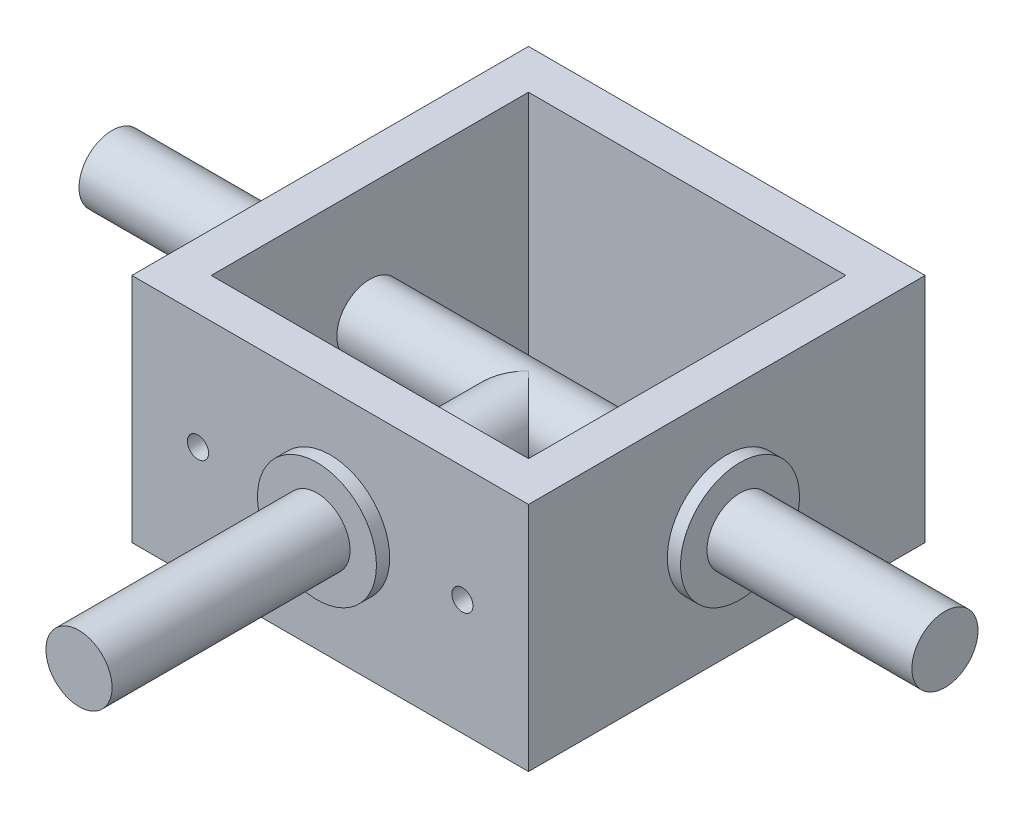
ISO-10303-21;
HEADER;
FILE_DESCRIPTION(('STEP AP214'),'2;1');
FILE_NAME('part.step','',(''),(''),'','','');
FILE_SCHEMA(('AUTOMOTIVE_DESIGN { 1 0 10303 214 1 1 1 1 }'));
ENDSEC;
DATA;
#1=APPLICATION_CONTEXT('core data for automotive mechanical design processes');
#2=APPLICATION_PROTOCOL_DEFINITION('international standard','automotive_design',2000,#1);
#3=PRODUCT_CONTEXT('',#1,'mechanical');
#4=PRODUCT('Part','Part','',(#3));
#5=PRODUCT_RELATED_PRODUCT_CATEGORY('part','',(#4));
#6=PRODUCT_DEFINITION_FORMATION('','',#4);
#7=PRODUCT_DEFINITION_CONTEXT('part definition',#1,'design');
#8=PRODUCT_DEFINITION('design','',#6,#7);
#9=PRODUCT_DEFINITION_SHAPE('','',#8);
#10=(LENGTH_UNIT() NAMED_UNIT(*) SI_UNIT(.MILLI.,.METRE.));
#11=(NAMED_UNIT(*) PLANE_ANGLE_UNIT() SI_UNIT($,.RADIAN.));
#12=(NAMED_UNIT(*) SI_UNIT($,.STERADIAN.) SOLID_ANGLE_UNIT());
#13=UNCERTAINTY_MEASURE_WITH_UNIT(LENGTH_MEASURE(1.E-05),#10,'distance_accuracy_value','');
#14=(GEOMETRIC_REPRESENTATION_CONTEXT(3) GLOBAL_UNCERTAINTY_ASSIGNED_CONTEXT((#13)) GLOBAL_UNIT_ASSIGNED_CONTEXT((#10,
#11,#12)) REPRESENTATION_CONTEXT('',''));
#15=CARTESIAN_POINT('',(0.,0.,0.));
#16=DIRECTION('',(0.,0.,1.));
#17=DIRECTION('',(1.,0.,0.));
#18=AXIS2_PLACEMENT_3D('',#15,#16,#17);
#19=CARTESIAN_POINT('',(-63.,0.,0.));
#20=DIRECTION('',(1.,0.,0.));
#21=DIRECTION('',(0.,0.,-1.));
#22=AXIS2_PLACEMENT_3D('',#19,#20,#21);
#23=CYLINDRICAL_SURFACE('',#22,5.);
#24=CARTESIAN_POINT('',(24.,0.,0.));
#25=DIRECTION('',(1.,0.,0.));
#26=DIRECTION('',(0.,0.,-1.));
#27=AXIS2_PLACEMENT_3D('',#24,#25,#26);
#28=CIRCLE('',#27,5.);
#29=CARTESIAN_POINT('',(24.,0.,-5.));
#30=VERTEX_POINT('',#29);
#31=EDGE_CURVE('E237',#30,#30,#28,.T.);
#32=ORIENTED_EDGE('',*,*,#31,.F.);
#33=EDGE_LOOP('',(#32));
#34=FACE_BOUND('',#33,.T.);
#35=CARTESIAN_POINT('',(-24.,0.,0.));
#36=DIRECTION('',(-1.,0.,0.));
#37=DIRECTION('',(0.,0.,1.));
#38=AXIS2_PLACEMENT_3D('',#35,#36,#37);
#39=CIRCLE('',#38,5.);
#40=CARTESIAN_POINT('',(-24.,0.,5.));
#41=VERTEX_POINT('',#40);
#42=EDGE_CURVE('E233',#41,#41,#39,.T.);
#43=ORIENTED_EDGE('',*,*,#42,.F.);
#44=EDGE_LOOP('',(#43));
#45=FACE_BOUND('',#44,.T.);
#46=CARTESIAN_POINT('',(0.,0.,0.));
#47=DIRECTION('',(0.707106781186547,0.,0.707106781186547));
#48=DIRECTION('',(0.707106781186547,0.,-0.707106781186547));
#49=AXIS2_PLACEMENT_3D('',#46,#47,#48);
#50=ELLIPSE('',#49,7.07106781186547,5.);
#51=CARTESIAN_POINT('',(0.,-5.,0.));
#52=VERTEX_POINT('',#51);
#53=CARTESIAN_POINT('',(0.,5.,0.));
#54=VERTEX_POINT('',#53);
#55=EDGE_CURVE('E109',#52,#54,#50,.F.);
#56=ORIENTED_EDGE('',*,*,#55,.T.);
#57=CARTESIAN_POINT('',(0.,0.,0.));
#58=DIRECTION('',(0.707106781186547,0.,-0.707106781186547));
#59=DIRECTION('',(0.707106781186547,0.,0.707106781186547));
#60=AXIS2_PLACEMENT_3D('',#57,#58,#59);
#61=ELLIPSE('',#60,7.07106781186547,5.);
#62=EDGE_CURVE('E44',#54,#52,#61,.T.);
#63=ORIENTED_EDGE('',*,*,#62,.T.);
#64=EDGE_LOOP('',(#56,#63));
#65=FACE_BOUND('',#64,.T.);
#66=ADVANCED_FACE('F40',(#34,#45,#65),#23,.T.);
#67=CARTESIAN_POINT('',(30.,-17.5,-30.));
#68=DIRECTION('',(1.,0.,0.));
#69=DIRECTION('',(0.,0.,-1.));
#70=AXIS2_PLACEMENT_3D('',#67,#68,#69);
#71=PLANE('',#70);
#72=CARTESIAN_POINT('',(30.,0.,0.));
#73=DIRECTION('',(1.,0.,0.));
#74=DIRECTION('',(0.,0.,-1.));
#75=AXIS2_PLACEMENT_3D('',#72,#73,#74);
#76=CIRCLE('',#75,9.);
#77=CARTESIAN_POINT('',(30.,0.,-9.00000000000001));
#78=VERTEX_POINT('',#77);
#79=EDGE_CURVE('E127',#78,#78,#76,.T.);
#80=ORIENTED_EDGE('',*,*,#79,.F.);
#81=EDGE_LOOP('',(#80));
#82=FACE_BOUND('',#81,.T.);
#83=DIRECTION('',(0.,1.,0.));
#84=VECTOR('',#83,1.);
#85=CARTESIAN_POINT('',(30.,-17.5,-30.));
#86=LINE('',#85,#84);
#87=CARTESIAN_POINT('',(30.,-17.5,-30.));
#88=VERTEX_POINT('',#87);
#89=CARTESIAN_POINT('',(30.,17.5,-30.));
#90=VERTEX_POINT('',#89);
#91=EDGE_CURVE('E144',#88,#90,#86,.T.);
#92=ORIENTED_EDGE('',*,*,#91,.T.);
#93=DIRECTION('',(0.,0.,-1.));
#94=VECTOR('',#93,1.);
#95=CARTESIAN_POINT('',(30.,17.5,-30.));
#96=LINE('',#95,#94);
#97=CARTESIAN_POINT('',(30.,17.5,30.));
#98=VERTEX_POINT('',#97);
#99=EDGE_CURVE('E201',#98,#90,#96,.T.);
#100=ORIENTED_EDGE('',*,*,#99,.F.);
#101=DIRECTION('',(0.,1.,0.));
#102=VECTOR('',#101,1.);
#103=CARTESIAN_POINT('',(30.,-17.5,30.));
#104=LINE('',#103,#102);
#105=CARTESIAN_POINT('',(30.,-17.5,30.));
#106=VERTEX_POINT('',#105);
#107=EDGE_CURVE('E135',#106,#98,#104,.T.);
#108=ORIENTED_EDGE('',*,*,#107,.F.);
#109=DIRECTION('',(0.,0.,-1.));
#110=VECTOR('',#109,1.);
#111=CARTESIAN_POINT('',(30.,-17.5,-30.));
#112=LINE('',#111,#110);
#113=EDGE_CURVE('E159',#106,#88,#112,.T.);
#114=ORIENTED_EDGE('',*,*,#113,.T.);
#115=EDGE_LOOP('',(#92,#100,#108,#114));
#116=FACE_BOUND('',#115,.T.);
#117=ADVANCED_FACE('F42',(#82,#116),#71,.T.);
#118=CARTESIAN_POINT('',(-30.,-17.5,30.));
#119=DIRECTION('',(0.,0.,1.));
#120=DIRECTION('',(1.,0.,0.));
#121=AXIS2_PLACEMENT_3D('',#118,#119,#120);
#122=PLANE('',#121);
#123=CARTESIAN_POINT('',(-20.,0.,30.));
#124=DIRECTION('',(0.,0.,1.));
#125=DIRECTION('',(1.,0.,0.));
#126=AXIS2_PLACEMENT_3D('',#123,#124,#125);
#127=CIRCLE('',#126,1.6);
#128=CARTESIAN_POINT('',(-18.4,0.,30.));
#129=VERTEX_POINT('',#128);
#130=EDGE_CURVE('E257',#129,#129,#127,.T.);
#131=ORIENTED_EDGE('',*,*,#130,.F.);
#132=EDGE_LOOP('',(#131));
#133=FACE_BOUND('',#132,.T.);
#134=CARTESIAN_POINT('',(20.,0.,30.));
#135=DIRECTION('',(0.,0.,1.));
#136=DIRECTION('',(1.,0.,0.));
#137=AXIS2_PLACEMENT_3D('',#134,#135,#136);
#138=CIRCLE('',#137,1.6);
#139=CARTESIAN_POINT('',(21.6,0.,30.));
#140=VERTEX_POINT('',#139);
#141=EDGE_CURVE('E265',#140,#140,#138,.T.);
#142=ORIENTED_EDGE('',*,*,#141,.F.);
#143=EDGE_LOOP('',(#142));
#144=FACE_BOUND('',#143,.T.);
#145=CARTESIAN_POINT('',(0.,0.,30.));
#146=DIRECTION('',(0.,0.,1.));
#147=DIRECTION('',(1.,0.,0.));
#148=AXIS2_PLACEMENT_3D('',#145,#146,#147);
#149=CIRCLE('',#148,9.);
#150=CARTESIAN_POINT('',(9.,0.,30.));
#151=VERTEX_POINT('',#150);
#152=EDGE_CURVE('E131',#151,#151,#149,.T.);
#153=ORIENTED_EDGE('',*,*,#152,.F.);
#154=EDGE_LOOP('',(#153));
#155=FACE_BOUND('',#154,.T.);
#156=ORIENTED_EDGE('',*,*,#107,.T.);
#157=DIRECTION('',(1.,0.,0.));
#158=VECTOR('',#157,1.);
#159=CARTESIAN_POINT('',(-30.,17.5,30.));
#160=LINE('',#159,#158);
#161=CARTESIAN_POINT('',(-30.,17.5,30.));
#162=VERTEX_POINT('',#161);
#163=EDGE_CURVE('E189',#162,#98,#160,.T.);
#164=ORIENTED_EDGE('',*,*,#163,.F.);
#165=DIRECTION('',(0.,1.,0.));
#166=VECTOR('',#165,1.);
#167=CARTESIAN_POINT('',(-30.,-17.5,30.));
#168=LINE('',#167,#166);
#169=CARTESIAN_POINT('',(-30.,-17.5,30.));
#170=VERTEX_POINT('',#169);
#171=EDGE_CURVE('E138',#170,#162,#168,.T.);
#172=ORIENTED_EDGE('',*,*,#171,.F.);
#173=DIRECTION('',(1.,0.,0.));
#174=VECTOR('',#173,1.);
#175=CARTESIAN_POINT('',(-30.,-17.5,30.));
#176=LINE('',#175,#174);
#177=EDGE_CURVE('E147',#170,#106,#176,.T.);
#178=ORIENTED_EDGE('',*,*,#177,.T.);
#179=EDGE_LOOP('',(#156,#164,#172,#178));
#180=FACE_BOUND('',#179,.T.);
#181=ADVANCED_FACE('F324',(#133,#144,#155,#180),#122,.T.);
#182=CARTESIAN_POINT('',(-30.,-17.5,-30.));
#183=DIRECTION('',(-1.,0.,0.));
#184=DIRECTION('',(0.,0.,1.));
#185=AXIS2_PLACEMENT_3D('',#182,#183,#184);
#186=PLANE('',#185);
#187=CARTESIAN_POINT('',(-30.,0.,0.));
#188=DIRECTION('',(-1.,0.,0.));
#189=DIRECTION('',(0.,0.,1.));
#190=AXIS2_PLACEMENT_3D('',#187,#188,#189);
#191=CIRCLE('',#190,9.);
#192=CARTESIAN_POINT('',(-30.,0.,9.00000000000001));
#193=VERTEX_POINT('',#192);
#194=EDGE_CURVE('E123',#193,#193,#191,.T.);
#195=ORIENTED_EDGE('',*,*,#194,.F.);
#196=EDGE_LOOP('',(#195));
#197=FACE_BOUND('',#196,.T.);
#198=ORIENTED_EDGE('',*,*,#171,.T.);
#199=DIRECTION('',(0.,0.,1.));
#200=VECTOR('',#199,1.);
#201=CARTESIAN_POINT('',(-30.,17.5,-30.));
#202=LINE('',#201,#200);
#203=CARTESIAN_POINT('',(-30.,17.5,-30.));
#204=VERTEX_POINT('',#203);
#205=EDGE_CURVE('E193',#204,#162,#202,.T.);
#206=ORIENTED_EDGE('',*,*,#205,.F.);
#207=DIRECTION('',(0.,1.,0.));
#208=VECTOR('',#207,1.);
#209=CARTESIAN_POINT('',(-30.,-17.5,-30.));
#210=LINE('',#209,#208);
#211=CARTESIAN_POINT('',(-30.,-17.5,-30.));
#212=VERTEX_POINT('',#211);
#213=EDGE_CURVE('E141',#212,#204,#210,.T.);
#214=ORIENTED_EDGE('',*,*,#213,.F.);
#215=DIRECTION('',(0.,0.,1.));
#216=VECTOR('',#215,1.);
#217=CARTESIAN_POINT('',(-30.,-17.5,-30.));
#218=LINE('',#217,#216);
#219=EDGE_CURVE('E151',#212,#170,#218,.T.);
#220=ORIENTED_EDGE('',*,*,#219,.T.);
#221=EDGE_LOOP('',(#198,#206,#214,#220));
#222=FACE_BOUND('',#221,.T.);
#223=ADVANCED_FACE('F359',(#197,#222),#186,.T.);
#224=CARTESIAN_POINT('',(-30.,-17.5,-30.));
#225=DIRECTION('',(0.,0.,-1.));
#226=DIRECTION('',(-1.,0.,0.));
#227=AXIS2_PLACEMENT_3D('',#224,#225,#226);
#228=PLANE('',#227);
#229=ORIENTED_EDGE('',*,*,#213,.T.);
#230=DIRECTION('',(-1.,0.,0.));
#231=VECTOR('',#230,1.);
#232=CARTESIAN_POINT('',(-30.,17.5,-30.));
#233=LINE('',#232,#231);
#234=EDGE_CURVE('E197',#90,#204,#233,.T.);
#235=ORIENTED_EDGE('',*,*,#234,.F.);
#236=ORIENTED_EDGE('',*,*,#91,.F.);
#237=DIRECTION('',(-1.,0.,0.));
#238=VECTOR('',#237,1.);
#239=CARTESIAN_POINT('',(-30.,-17.5,-30.));
#240=LINE('',#239,#238);
#241=EDGE_CURVE('E155',#88,#212,#240,.T.);
#242=ORIENTED_EDGE('',*,*,#241,.T.);
#243=EDGE_LOOP('',(#229,#235,#236,#242));
#244=FACE_BOUND('',#243,.T.);
#245=ADVANCED_FACE('F362',(#244),#228,.T.);
#246=CARTESIAN_POINT('',(0.,-17.5,0.));
#247=DIRECTION('',(0.,1.,0.));
#248=DIRECTION('',(0.,0.,1.));
#249=AXIS2_PLACEMENT_3D('',#246,#247,#248);
#250=PLANE('',#249);
#251=DIRECTION('',(-1.,0.,0.));
#252=VECTOR('',#251,1.);
#253=CARTESIAN_POINT('',(-24.,-17.5,-24.));
#254=LINE('',#253,#252);
#255=CARTESIAN_POINT('',(24.,-17.5,-24.));
#256=VERTEX_POINT('',#255);
#257=CARTESIAN_POINT('',(-24.,-17.5,-24.));
#258=VERTEX_POINT('',#257);
#259=EDGE_CURVE('E175',#256,#258,#254,.T.);
#260=ORIENTED_EDGE('',*,*,#259,.T.);
#261=DIRECTION('',(0.,0.,1.));
#262=VECTOR('',#261,1.);
#263=CARTESIAN_POINT('',(-24.,-17.5,24.));
#264=LINE('',#263,#262);
#265=CARTESIAN_POINT('',(-24.,-17.5,24.));
#266=VERTEX_POINT('',#265);
#267=EDGE_CURVE('E185',#258,#266,#264,.T.);
#268=ORIENTED_EDGE('',*,*,#267,.T.);
#269=DIRECTION('',(1.,0.,0.));
#270=VECTOR('',#269,1.);
#271=CARTESIAN_POINT('',(-24.,-17.5,24.));
#272=LINE('',#271,#270);
#273=CARTESIAN_POINT('',(24.,-17.5,24.));
#274=VERTEX_POINT('',#273);
#275=EDGE_CURVE('E181',#266,#274,#272,.T.);
#276=ORIENTED_EDGE('',*,*,#275,.T.);
#277=DIRECTION('',(0.,0.,-1.));
#278=VECTOR('',#277,1.);
#279=CARTESIAN_POINT('',(24.,-17.5,24.));
#280=LINE('',#279,#278);
#281=EDGE_CURVE('E63',#274,#256,#280,.T.);
#282=ORIENTED_EDGE('',*,*,#281,.T.);
#283=EDGE_LOOP('',(#260,#268,#276,#282));
#284=FACE_BOUND('',#283,.T.);
#285=ORIENTED_EDGE('',*,*,#113,.F.);
#286=ORIENTED_EDGE('',*,*,#177,.F.);
#287=ORIENTED_EDGE('',*,*,#219,.F.);
#288=ORIENTED_EDGE('',*,*,#241,.F.);
#289=EDGE_LOOP('',(#285,#286,#287,#288));
#290=FACE_BOUND('',#289,.T.);
#291=ADVANCED_FACE('F297',(#284,#290),#250,.F.);
#292=CARTESIAN_POINT('',(-24.,-17.5,24.));
#293=DIRECTION('',(-1.,0.,0.));
#294=DIRECTION('',(0.,0.,1.));
#295=AXIS2_PLACEMENT_3D('',#292,#293,#294);
#296=PLANE('',#295);
#297=ORIENTED_EDGE('',*,*,#42,.T.);
#298=EDGE_LOOP('',(#297));
#299=FACE_BOUND('',#298,.T.);
#300=DIRECTION('',(0.,1.,0.));
#301=VECTOR('',#300,1.);
#302=CARTESIAN_POINT('',(-24.,-17.5,-24.));
#303=LINE('',#302,#301);
#304=CARTESIAN_POINT('',(-24.,17.5,-24.));
#305=VERTEX_POINT('',#304);
#306=EDGE_CURVE('E163',#258,#305,#303,.T.);
#307=ORIENTED_EDGE('',*,*,#306,.T.);
#308=DIRECTION('',(0.,0.,1.));
#309=VECTOR('',#308,1.);
#310=CARTESIAN_POINT('',(-24.,17.5,24.));
#311=LINE('',#310,#309);
#312=CARTESIAN_POINT('',(-24.,17.5,24.));
#313=VERTEX_POINT('',#312);
#314=EDGE_CURVE('E217',#305,#313,#311,.T.);
#315=ORIENTED_EDGE('',*,*,#314,.T.);
#316=DIRECTION('',(0.,1.,0.));
#317=VECTOR('',#316,1.);
#318=CARTESIAN_POINT('',(-24.,-17.5,24.));
#319=LINE('',#318,#317);
#320=EDGE_CURVE('E172',#266,#313,#319,.T.);
#321=ORIENTED_EDGE('',*,*,#320,.F.);
#322=ORIENTED_EDGE('',*,*,#267,.F.);
#323=EDGE_LOOP('',(#307,#315,#321,#322));
#324=FACE_BOUND('',#323,.T.);
#325=ADVANCED_FACE('F292',(#299,#324),#296,.F.);
#326=CARTESIAN_POINT('',(-24.,-17.5,-24.));
#327=DIRECTION('',(0.,0.,-1.));
#328=DIRECTION('',(-1.,0.,0.));
#329=AXIS2_PLACEMENT_3D('',#326,#327,#328);
#330=PLANE('',#329);
#331=DIRECTION('',(0.,1.,0.));
#332=VECTOR('',#331,1.);
#333=CARTESIAN_POINT('',(24.,-17.5,-24.));
#334=LINE('',#333,#332);
#335=CARTESIAN_POINT('',(24.,17.5,-24.));
#336=VERTEX_POINT('',#335);
#337=EDGE_CURVE('E166',#256,#336,#334,.T.);
#338=ORIENTED_EDGE('',*,*,#337,.T.);
#339=DIRECTION('',(-1.,0.,0.));
#340=VECTOR('',#339,1.);
#341=CARTESIAN_POINT('',(-24.,17.5,-24.));
#342=LINE('',#341,#340);
#343=EDGE_CURVE('E205',#336,#305,#342,.T.);
#344=ORIENTED_EDGE('',*,*,#343,.T.);
#345=ORIENTED_EDGE('',*,*,#306,.F.);
#346=ORIENTED_EDGE('',*,*,#259,.F.);
#347=EDGE_LOOP('',(#338,#344,#345,#346));
#348=FACE_BOUND('',#347,.T.);
#349=ADVANCED_FACE('F300',(#348),#330,.F.);
#350=CARTESIAN_POINT('',(24.,-17.5,24.));
#351=DIRECTION('',(1.,0.,0.));
#352=DIRECTION('',(0.,0.,-1.));
#353=AXIS2_PLACEMENT_3D('',#350,#351,#352);
#354=PLANE('',#353);
#355=ORIENTED_EDGE('',*,*,#31,.T.);
#356=EDGE_LOOP('',(#355));
#357=FACE_BOUND('',#356,.T.);
#358=DIRECTION('',(0.,1.,0.));
#359=VECTOR('',#358,1.);
#360=CARTESIAN_POINT('',(24.,-17.5,24.));
#361=LINE('',#360,#359);
#362=CARTESIAN_POINT('',(24.,17.5,24.));
#363=VERTEX_POINT('',#362);
#364=EDGE_CURVE('E169',#274,#363,#361,.T.);
#365=ORIENTED_EDGE('',*,*,#364,.T.);
#366=DIRECTION('',(0.,0.,-1.));
#367=VECTOR('',#366,1.);
#368=CARTESIAN_POINT('',(24.,17.5,24.));
#369=LINE('',#368,#367);
#370=EDGE_CURVE('E209',#363,#336,#369,.T.);
#371=ORIENTED_EDGE('',*,*,#370,.T.);
#372=ORIENTED_EDGE('',*,*,#337,.F.);
#373=ORIENTED_EDGE('',*,*,#281,.F.);
#374=EDGE_LOOP('',(#365,#371,#372,#373));
#375=FACE_BOUND('',#374,.T.);
#376=ADVANCED_FACE('F281',(#357,#375),#354,.F.);
#377=CARTESIAN_POINT('',(-24.,-17.5,24.));
#378=DIRECTION('',(0.,0.,1.));
#379=DIRECTION('',(1.,0.,0.));
#380=AXIS2_PLACEMENT_3D('',#377,#378,#379);
#381=PLANE('',#380);
#382=CARTESIAN_POINT('',(-20.,0.,24.));
#383=DIRECTION('',(0.,0.,1.));
#384=DIRECTION('',(1.,0.,0.));
#385=AXIS2_PLACEMENT_3D('',#382,#383,#384);
#386=CIRCLE('',#385,1.6);
#387=CARTESIAN_POINT('',(-18.4,0.,24.));
#388=VERTEX_POINT('',#387);
#389=EDGE_CURVE('E261',#388,#388,#386,.F.);
#390=ORIENTED_EDGE('',*,*,#389,.F.);
#391=EDGE_LOOP('',(#390));
#392=FACE_BOUND('',#391,.T.);
#393=CARTESIAN_POINT('',(20.,0.,24.));
#394=DIRECTION('',(0.,0.,1.));
#395=DIRECTION('',(1.,0.,0.));
#396=AXIS2_PLACEMENT_3D('',#393,#394,#395);
#397=CIRCLE('',#396,1.6);
#398=CARTESIAN_POINT('',(21.6,0.,24.));
#399=VERTEX_POINT('',#398);
#400=EDGE_CURVE('E269',#399,#399,#397,.F.);
#401=ORIENTED_EDGE('',*,*,#400,.F.);
#402=EDGE_LOOP('',(#401));
#403=FACE_BOUND('',#402,.T.);
#404=CARTESIAN_POINT('',(0.,0.,24.));
#405=DIRECTION('',(0.,0.,1.));
#406=DIRECTION('',(1.,0.,0.));
#407=AXIS2_PLACEMENT_3D('',#404,#405,#406);
#408=CIRCLE('',#407,5.);
#409=CARTESIAN_POINT('',(5.,0.,24.));
#410=VERTEX_POINT('',#409);
#411=EDGE_CURVE('E11',#410,#410,#408,.F.);
#412=ORIENTED_EDGE('',*,*,#411,.F.);
#413=EDGE_LOOP('',(#412));
#414=FACE_BOUND('',#413,.T.);
#415=ORIENTED_EDGE('',*,*,#320,.T.);
#416=DIRECTION('',(1.,0.,0.));
#417=VECTOR('',#416,1.);
#418=CARTESIAN_POINT('',(-24.,17.5,24.));
#419=LINE('',#418,#417);
#420=EDGE_CURVE('E213',#313,#363,#419,.T.);
#421=ORIENTED_EDGE('',*,*,#420,.T.);
#422=ORIENTED_EDGE('',*,*,#364,.F.);
#423=ORIENTED_EDGE('',*,*,#275,.F.);
#424=EDGE_LOOP('',(#415,#421,#422,#423));
#425=FACE_BOUND('',#424,.T.);
#426=ADVANCED_FACE('F277',(#392,#403,#414,#425),#381,.F.);
#427=CARTESIAN_POINT('',(0.,17.5,0.));
#428=DIRECTION('',(0.,1.,0.));
#429=DIRECTION('',(0.,0.,1.));
#430=AXIS2_PLACEMENT_3D('',#427,#428,#429);
#431=PLANE('',#430);
#432=ORIENTED_EDGE('',*,*,#99,.T.);
#433=ORIENTED_EDGE('',*,*,#234,.T.);
#434=ORIENTED_EDGE('',*,*,#205,.T.);
#435=ORIENTED_EDGE('',*,*,#163,.T.);
#436=EDGE_LOOP('',(#432,#433,#434,#435));
#437=FACE_BOUND('',#436,.T.);
#438=ORIENTED_EDGE('',*,*,#420,.F.);
#439=ORIENTED_EDGE('',*,*,#314,.F.);
#440=ORIENTED_EDGE('',*,*,#343,.F.);
#441=ORIENTED_EDGE('',*,*,#370,.F.);
#442=EDGE_LOOP('',(#438,#439,#440,#441));
#443=FACE_BOUND('',#442,.T.);
#444=ADVANCED_FACE('F280',(#437,#443),#431,.T.);
#445=CARTESIAN_POINT('',(0.,0.,32.));
#446=DIRECTION('',(0.,0.,-1.));
#447=DIRECTION('',(-1.,0.,0.));
#448=AXIS2_PLACEMENT_3D('',#445,#446,#447);
#449=CYLINDRICAL_SURFACE('',#448,9.);
#450=CARTESIAN_POINT('',(0.,0.,32.));
#451=DIRECTION('',(0.,0.,1.));
#452=DIRECTION('',(1.,0.,0.));
#453=AXIS2_PLACEMENT_3D('',#450,#451,#452);
#454=CIRCLE('',#453,9.);
#455=CARTESIAN_POINT('',(9.,0.,32.));
#456=VERTEX_POINT('',#455);
#457=EDGE_CURVE('E221',#456,#456,#454,.T.);
#458=ORIENTED_EDGE('',*,*,#457,.F.);
#459=EDGE_LOOP('',(#458));
#460=FACE_BOUND('',#459,.T.);
#461=ORIENTED_EDGE('',*,*,#152,.T.);
#462=EDGE_LOOP('',(#461));
#463=FACE_BOUND('',#462,.T.);
#464=ADVANCED_FACE('F394',(#460,#463),#449,.T.);
#465=CARTESIAN_POINT('',(0.,0.,32.));
#466=DIRECTION('',(0.,0.,1.));
#467=DIRECTION('',(1.,0.,0.));
#468=AXIS2_PLACEMENT_3D('',#465,#466,#467);
#469=PLANE('',#468);
#470=CARTESIAN_POINT('',(0.,0.,32.));
#471=DIRECTION('',(0.,0.,1.));
#472=DIRECTION('',(1.,0.,0.));
#473=AXIS2_PLACEMENT_3D('',#470,#471,#472);
#474=CIRCLE('',#473,5.);
#475=CARTESIAN_POINT('',(5.,0.,32.));
#476=VERTEX_POINT('',#475);
#477=EDGE_CURVE('E249',#476,#476,#474,.F.);
#478=ORIENTED_EDGE('',*,*,#477,.T.);
#479=EDGE_LOOP('',(#478));
#480=FACE_BOUND('',#479,.T.);
#481=ORIENTED_EDGE('',*,*,#457,.T.);
#482=EDGE_LOOP('',(#481));
#483=FACE_BOUND('',#482,.T.);
#484=ADVANCED_FACE('F395',(#480,#483),#469,.T.);
#485=CARTESIAN_POINT('',(32.,0.,0.));
#486=DIRECTION('',(-1.,0.,0.));
#487=DIRECTION('',(0.,0.,1.));
#488=AXIS2_PLACEMENT_3D('',#485,#486,#487);
#489=CYLINDRICAL_SURFACE('',#488,9.);
#490=CARTESIAN_POINT('',(32.,0.,0.));
#491=DIRECTION('',(1.,0.,0.));
#492=DIRECTION('',(0.,0.,-1.));
#493=AXIS2_PLACEMENT_3D('',#490,#491,#492);
#494=CIRCLE('',#493,9.);
#495=CARTESIAN_POINT('',(32.,0.,-9.00000000000001));
#496=VERTEX_POINT('',#495);
#497=EDGE_CURVE('E225',#496,#496,#494,.T.);
#498=ORIENTED_EDGE('',*,*,#497,.F.);
#499=EDGE_LOOP('',(#498));
#500=FACE_BOUND('',#499,.T.);
#501=ORIENTED_EDGE('',*,*,#79,.T.);
#502=EDGE_LOOP('',(#501));
#503=FACE_BOUND('',#502,.T.);
#504=ADVANCED_FACE('F401',(#500,#503),#489,.T.);
#505=CARTESIAN_POINT('',(32.,0.,0.));
#506=DIRECTION('',(1.,0.,0.));
#507=DIRECTION('',(0.,0.,-1.));
#508=AXIS2_PLACEMENT_3D('',#505,#506,#507);
#509=PLANE('',#508);
#510=CARTESIAN_POINT('',(32.,0.,0.));
#511=DIRECTION('',(1.,0.,0.));
#512=DIRECTION('',(0.,0.,-1.));
#513=AXIS2_PLACEMENT_3D('',#510,#511,#512);
#514=CIRCLE('',#513,5.);
#515=CARTESIAN_POINT('',(32.,0.,-5.));
#516=VERTEX_POINT('',#515);
#517=EDGE_CURVE('E114',#516,#516,#514,.T.);
#518=ORIENTED_EDGE('',*,*,#517,.F.);
#519=EDGE_LOOP('',(#518));
#520=FACE_BOUND('',#519,.T.);
#521=ORIENTED_EDGE('',*,*,#497,.T.);
#522=EDGE_LOOP('',(#521));
#523=FACE_BOUND('',#522,.T.);
#524=ADVANCED_FACE('F355',(#520,#523),#509,.T.);
#525=CARTESIAN_POINT('',(-32.,0.,0.));
#526=DIRECTION('',(1.,0.,0.));
#527=DIRECTION('',(0.,0.,-1.));
#528=AXIS2_PLACEMENT_3D('',#525,#526,#527);
#529=CYLINDRICAL_SURFACE('',#528,9.);
#530=CARTESIAN_POINT('',(-32.,0.,0.));
#531=DIRECTION('',(-1.,0.,0.));
#532=DIRECTION('',(0.,0.,1.));
#533=AXIS2_PLACEMENT_3D('',#530,#531,#532);
#534=CIRCLE('',#533,9.);
#535=CARTESIAN_POINT('',(-32.,0.,9.00000000000001));
#536=VERTEX_POINT('',#535);
#537=EDGE_CURVE('E229',#536,#536,#534,.T.);
#538=ORIENTED_EDGE('',*,*,#537,.F.);
#539=EDGE_LOOP('',(#538));
#540=FACE_BOUND('',#539,.T.);
#541=ORIENTED_EDGE('',*,*,#194,.T.);
#542=EDGE_LOOP('',(#541));
#543=FACE_BOUND('',#542,.T.);
#544=ADVANCED_FACE('F350',(#540,#543),#529,.T.);
#545=CARTESIAN_POINT('',(-32.,0.,0.));
#546=DIRECTION('',(-1.,0.,0.));
#547=DIRECTION('',(0.,0.,1.));
#548=AXIS2_PLACEMENT_3D('',#545,#546,#547);
#549=PLANE('',#548);
#550=CARTESIAN_POINT('',(-32.,0.,0.));
#551=DIRECTION('',(-1.,0.,0.));
#552=DIRECTION('',(0.,0.,1.));
#553=AXIS2_PLACEMENT_3D('',#550,#551,#552);
#554=CIRCLE('',#553,5.);
#555=CARTESIAN_POINT('',(-32.,0.,5.));
#556=VERTEX_POINT('',#555);
#557=EDGE_CURVE('E119',#556,#556,#554,.T.);
#558=ORIENTED_EDGE('',*,*,#557,.F.);
#559=EDGE_LOOP('',(#558));
#560=FACE_BOUND('',#559,.T.);
#561=ORIENTED_EDGE('',*,*,#537,.T.);
#562=EDGE_LOOP('',(#561));
#563=FACE_BOUND('',#562,.T.);
#564=ADVANCED_FACE('F342',(#560,#563),#549,.T.);
#565=CARTESIAN_POINT('',(-63.,0.,0.));
#566=DIRECTION('',(1.,0.,0.));
#567=DIRECTION('',(0.,0.,-1.));
#568=AXIS2_PLACEMENT_3D('',#565,#566,#567);
#569=PLANE('',#568);
#570=CARTESIAN_POINT('',(-63.,0.,0.));
#571=DIRECTION('',(1.,0.,0.));
#572=DIRECTION('',(0.,0.,-1.));
#573=AXIS2_PLACEMENT_3D('',#570,#571,#572);
#574=CIRCLE('',#573,5.);
#575=CARTESIAN_POINT('',(-63.,0.,-5.));
#576=VERTEX_POINT('',#575);
#577=EDGE_CURVE('E241',#576,#576,#574,.T.);
#578=ORIENTED_EDGE('',*,*,#577,.F.);
#579=EDGE_LOOP('',(#578));
#580=FACE_BOUND('',#579,.T.);
#581=ADVANCED_FACE('F334',(#580),#569,.F.);
#582=ORIENTED_EDGE('',*,*,#557,.T.);
#583=EDGE_LOOP('',(#582));
#584=FACE_BOUND('',#583,.T.);
#585=ORIENTED_EDGE('',*,*,#577,.T.);
#586=EDGE_LOOP('',(#585));
#587=FACE_BOUND('',#586,.T.);
#588=ADVANCED_FACE('F318',(#584,#587),#23,.T.);
#589=CARTESIAN_POINT('',(63.,0.,0.));
#590=DIRECTION('',(1.,0.,0.));
#591=DIRECTION('',(0.,0.,-1.));
#592=AXIS2_PLACEMENT_3D('',#589,#590,#591);
#593=PLANE('',#592);
#594=CARTESIAN_POINT('',(63.,0.,0.));
#595=DIRECTION('',(1.,0.,0.));
#596=DIRECTION('',(0.,0.,-1.));
#597=AXIS2_PLACEMENT_3D('',#594,#595,#596);
#598=CIRCLE('',#597,5.);
#599=CARTESIAN_POINT('',(63.,0.,-5.));
#600=VERTEX_POINT('',#599);
#601=EDGE_CURVE('E245',#600,#600,#598,.T.);
#602=ORIENTED_EDGE('',*,*,#601,.T.);
#603=EDGE_LOOP('',(#602));
#604=FACE_BOUND('',#603,.T.);
#605=ADVANCED_FACE('F331',(#604),#593,.T.);
#606=ORIENTED_EDGE('',*,*,#517,.T.);
#607=EDGE_LOOP('',(#606));
#608=FACE_BOUND('',#607,.T.);
#609=ORIENTED_EDGE('',*,*,#601,.F.);
#610=EDGE_LOOP('',(#609));
#611=FACE_BOUND('',#610,.T.);
#612=ADVANCED_FACE('F317',(#608,#611),#23,.T.);
#613=CARTESIAN_POINT('',(0.,0.,68.));
#614=DIRECTION('',(0.,0.,-1.));
#615=DIRECTION('',(-1.,0.,0.));
#616=AXIS2_PLACEMENT_3D('',#613,#614,#615);
#617=CYLINDRICAL_SURFACE('',#616,5.);
#618=ORIENTED_EDGE('',*,*,#62,.F.);
#619=ORIENTED_EDGE('',*,*,#55,.F.);
#620=EDGE_LOOP('',(#618,#619));
#621=FACE_BOUND('',#620,.T.);
#622=ORIENTED_EDGE('',*,*,#411,.T.);
#623=EDGE_LOOP('',(#622));
#624=FACE_BOUND('',#623,.T.);
#625=ADVANCED_FACE('F110',(#621,#624),#617,.T.);
#626=ORIENTED_EDGE('',*,*,#477,.F.);
#627=EDGE_LOOP('',(#626));
#628=FACE_BOUND('',#627,.T.);
#629=CARTESIAN_POINT('',(0.,0.,68.));
#630=DIRECTION('',(0.,0.,1.));
#631=DIRECTION('',(1.,0.,0.));
#632=AXIS2_PLACEMENT_3D('',#629,#630,#631);
#633=CIRCLE('',#632,5.);
#634=CARTESIAN_POINT('',(5.,0.,68.));
#635=VERTEX_POINT('',#634);
#636=EDGE_CURVE('E253',#635,#635,#633,.T.);
#637=ORIENTED_EDGE('',*,*,#636,.F.);
#638=EDGE_LOOP('',(#637));
#639=FACE_BOUND('',#638,.T.);
#640=ADVANCED_FACE('F471',(#628,#639),#617,.T.);
#641=CARTESIAN_POINT('',(0.,0.,68.));
#642=DIRECTION('',(0.,0.,1.));
#643=DIRECTION('',(1.,0.,0.));
#644=AXIS2_PLACEMENT_3D('',#641,#642,#643);
#645=PLANE('',#644);
#646=ORIENTED_EDGE('',*,*,#636,.T.);
#647=EDGE_LOOP('',(#646));
#648=FACE_BOUND('',#647,.T.);
#649=ADVANCED_FACE('F479',(#648),#645,.T.);
#650=CARTESIAN_POINT('',(20.,0.,-30.001));
#651=DIRECTION('',(0.,0.,1.));
#652=DIRECTION('',(1.,0.,0.));
#653=AXIS2_PLACEMENT_3D('',#650,#651,#652);
#654=CYLINDRICAL_SURFACE('',#653,1.6);
#655=ORIENTED_EDGE('',*,*,#141,.T.);
#656=EDGE_LOOP('',(#655));
#657=FACE_BOUND('',#656,.T.);
#658=ORIENTED_EDGE('',*,*,#400,.T.);
#659=EDGE_LOOP('',(#658));
#660=FACE_BOUND('',#659,.T.);
#661=ADVANCED_FACE('F275',(#657,#660),#654,.F.);
#662=CARTESIAN_POINT('',(-20.,0.,-30.001));
#663=DIRECTION('',(0.,0.,1.));
#664=DIRECTION('',(1.,0.,0.));
#665=AXIS2_PLACEMENT_3D('',#662,#663,#664);
#666=CYLINDRICAL_SURFACE('',#665,1.6);
#667=ORIENTED_EDGE('',*,*,#130,.T.);
#668=EDGE_LOOP('',(#667));
#669=FACE_BOUND('',#668,.T.);
#670=ORIENTED_EDGE('',*,*,#389,.T.);
#671=EDGE_LOOP('',(#670));
#672=FACE_BOUND('',#671,.T.);
#673=ADVANCED_FACE('F497',(#669,#672),#666,.F.);
#674=CLOSED_SHELL('',(#66,#117,#181,#223,#245,#291,#325,#349,#376,#426,#444,#464,#484,#504,#524,
#544,#564,#581,#588,#605,#612,#625,#640,#649,#661,#673));
#675=MANIFOLD_SOLID_BREP('B2',#674);
#676=ADVANCED_BREP_SHAPE_REPRESENTATION('',(#18,#675),#14);
#677=SHAPE_DEFINITION_REPRESENTATION(#9,#676);
ENDSEC;
END-ISO-10303-21;
